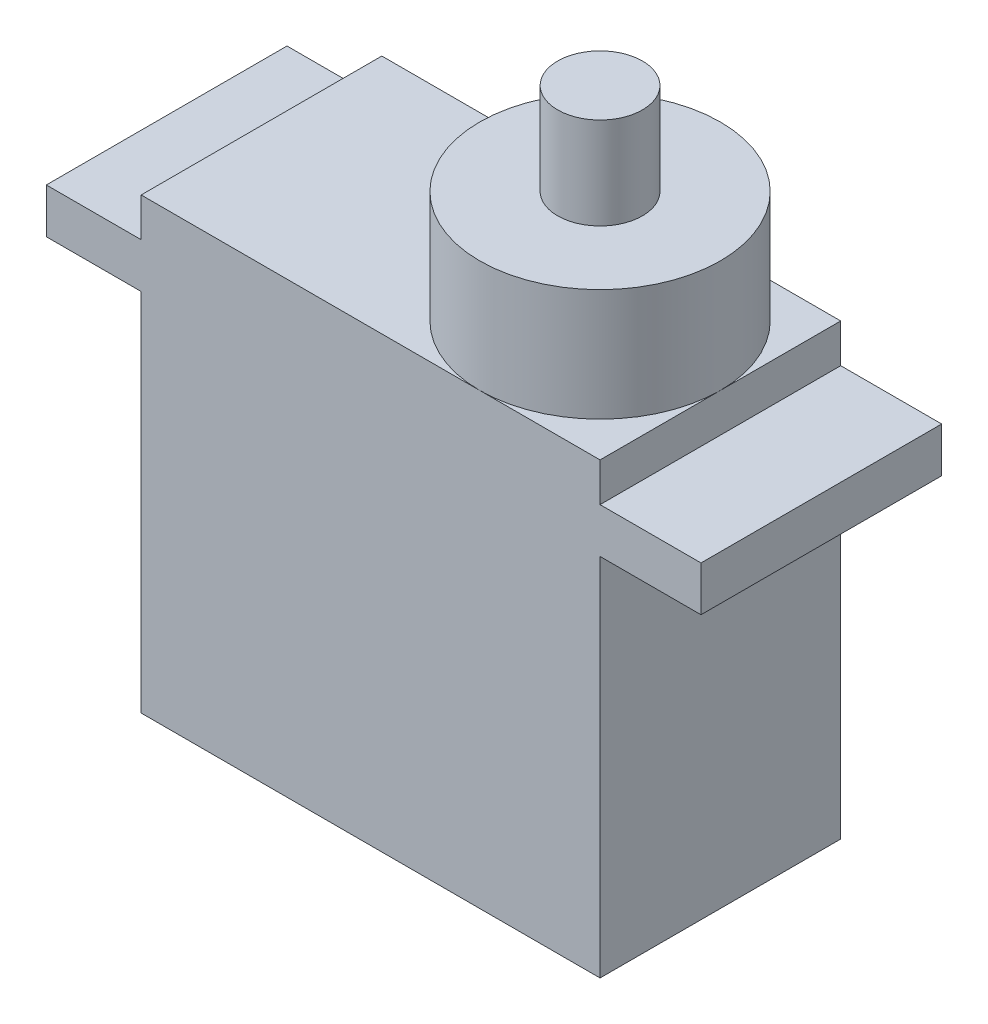
ISO-10303-21;
HEADER;
FILE_DESCRIPTION(('STEP AP214'),'2;1');
FILE_NAME('part.step','',(''),(''),'','','');
FILE_SCHEMA(('AUTOMOTIVE_DESIGN { 1 0 10303 214 1 1 1 1 }'));
ENDSEC;
DATA;
#1=APPLICATION_CONTEXT('core data for automotive mechanical design processes');
#2=APPLICATION_PROTOCOL_DEFINITION('international standard','automotive_design',2000,#1);
#3=PRODUCT_CONTEXT('',#1,'mechanical');
#4=PRODUCT('Part','Part','',(#3));
#5=PRODUCT_RELATED_PRODUCT_CATEGORY('part','',(#4));
#6=PRODUCT_DEFINITION_FORMATION('','',#4);
#7=PRODUCT_DEFINITION_CONTEXT('part definition',#1,'design');
#8=PRODUCT_DEFINITION('design','',#6,#7);
#9=PRODUCT_DEFINITION_SHAPE('','',#8);
#10=(LENGTH_UNIT() NAMED_UNIT(*) SI_UNIT(.MILLI.,.METRE.));
#11=(NAMED_UNIT(*) PLANE_ANGLE_UNIT() SI_UNIT($,.RADIAN.));
#12=(NAMED_UNIT(*) SI_UNIT($,.STERADIAN.) SOLID_ANGLE_UNIT());
#13=UNCERTAINTY_MEASURE_WITH_UNIT(LENGTH_MEASURE(1.E-05),#10,'distance_accuracy_value','');
#14=(GEOMETRIC_REPRESENTATION_CONTEXT(3) GLOBAL_UNCERTAINTY_ASSIGNED_CONTEXT((#13)) GLOBAL_UNIT_ASSIGNED_CONTEXT((#10,
#11,#12)) REPRESENTATION_CONTEXT('',''));
#15=CARTESIAN_POINT('',(0.,0.,0.));
#16=DIRECTION('',(0.,0.,1.));
#17=DIRECTION('',(1.,0.,0.));
#18=AXIS2_PLACEMENT_3D('',#15,#16,#17);
#19=CARTESIAN_POINT('',(22.5,17.9,-11.8));
#20=DIRECTION('',(-1.,0.,0.));
#21=DIRECTION('',(0.,0.,1.));
#22=AXIS2_PLACEMENT_3D('',#19,#20,#21);
#23=PLANE('',#22);
#24=DIRECTION('',(0.,0.,-1.));
#25=VECTOR('',#24,1.);
#26=CARTESIAN_POINT('',(22.5,17.9,-11.8));
#27=LINE('',#26,#25);
#28=CARTESIAN_POINT('',(22.5,17.9,0.));
#29=VERTEX_POINT('',#28);
#30=CARTESIAN_POINT('',(22.5,17.9,-11.8));
#31=VERTEX_POINT('',#30);
#32=EDGE_CURVE('E165',#29,#31,#27,.T.);
#33=ORIENTED_EDGE('',*,*,#32,.F.);
#34=DIRECTION('',(0.,-1.,0.));
#35=VECTOR('',#34,1.);
#36=CARTESIAN_POINT('',(22.5,17.9,0.));
#37=LINE('',#36,#35);
#38=CARTESIAN_POINT('',(22.5,0.,0.));
#39=VERTEX_POINT('',#38);
#40=EDGE_CURVE('E211',#29,#39,#37,.T.);
#41=ORIENTED_EDGE('',*,*,#40,.T.);
#42=DIRECTION('',(0.,0.,-1.));
#43=VECTOR('',#42,1.);
#44=CARTESIAN_POINT('',(22.5,0.,-11.8));
#45=LINE('',#44,#43);
#46=CARTESIAN_POINT('',(22.5,0.,-11.8));
#47=VERTEX_POINT('',#46);
#48=EDGE_CURVE('E199',#39,#47,#45,.T.);
#49=ORIENTED_EDGE('',*,*,#48,.T.);
#50=DIRECTION('',(0.,-1.,0.));
#51=VECTOR('',#50,1.);
#52=CARTESIAN_POINT('',(22.5,17.9,-11.8));
#53=LINE('',#52,#51);
#54=EDGE_CURVE('E219',#31,#47,#53,.T.);
#55=ORIENTED_EDGE('',*,*,#54,.F.);
#56=EDGE_LOOP('',(#33,#41,#49,#55));
#57=FACE_BOUND('',#56,.T.);
#58=ADVANCED_FACE('F37',(#57),#23,.F.);
#59=CARTESIAN_POINT('',(0.,17.9,-11.8));
#60=DIRECTION('',(1.,0.,0.));
#61=DIRECTION('',(0.,0.,-1.));
#62=AXIS2_PLACEMENT_3D('',#59,#60,#61);
#63=PLANE('',#62);
#64=DIRECTION('',(0.,0.,1.));
#65=VECTOR('',#64,1.);
#66=CARTESIAN_POINT('',(0.,17.9,-11.8));
#67=LINE('',#66,#65);
#68=CARTESIAN_POINT('',(0.,17.9,-11.8));
#69=VERTEX_POINT('',#68);
#70=CARTESIAN_POINT('',(0.,17.9,0.));
#71=VERTEX_POINT('',#70);
#72=EDGE_CURVE('E62',#69,#71,#67,.T.);
#73=ORIENTED_EDGE('',*,*,#72,.F.);
#74=DIRECTION('',(0.,-1.,0.));
#75=VECTOR('',#74,1.);
#76=CARTESIAN_POINT('',(0.,17.9,-11.8));
#77=LINE('',#76,#75);
#78=CARTESIAN_POINT('',(0.,0.,-11.8));
#79=VERTEX_POINT('',#78);
#80=EDGE_CURVE('E217',#69,#79,#77,.T.);
#81=ORIENTED_EDGE('',*,*,#80,.T.);
#82=DIRECTION('',(0.,0.,1.));
#83=VECTOR('',#82,1.);
#84=CARTESIAN_POINT('',(0.,0.,-11.8));
#85=LINE('',#84,#83);
#86=CARTESIAN_POINT('',(0.,0.,0.));
#87=VERTEX_POINT('',#86);
#88=EDGE_CURVE('E205',#79,#87,#85,.T.);
#89=ORIENTED_EDGE('',*,*,#88,.T.);
#90=DIRECTION('',(0.,-1.,0.));
#91=VECTOR('',#90,1.);
#92=CARTESIAN_POINT('',(0.,17.9,0.));
#93=LINE('',#92,#91);
#94=EDGE_CURVE('E214',#71,#87,#93,.T.);
#95=ORIENTED_EDGE('',*,*,#94,.F.);
#96=EDGE_LOOP('',(#73,#81,#89,#95));
#97=FACE_BOUND('',#96,.T.);
#98=ADVANCED_FACE('F222',(#97),#63,.F.);
#99=CARTESIAN_POINT('',(0.,22.,0.));
#100=DIRECTION('',(0.,1.,0.));
#101=DIRECTION('',(0.,0.,1.));
#102=AXIS2_PLACEMENT_3D('',#99,#100,#101);
#103=PLANE('',#102);
#104=CARTESIAN_POINT('',(16.6,22.,-5.9));
#105=DIRECTION('',(0.,1.,0.));
#106=DIRECTION('',(0.,0.,1.));
#107=AXIS2_PLACEMENT_3D('',#104,#105,#106);
#108=CIRCLE('',#107,5.9);
#109=CARTESIAN_POINT('',(16.6,22.,0.));
#110=VERTEX_POINT('',#109);
#111=CARTESIAN_POINT('',(22.5,22.,-5.9));
#112=VERTEX_POINT('',#111);
#113=EDGE_CURVE('E177',#110,#112,#108,.T.);
#114=ORIENTED_EDGE('',*,*,#113,.F.);
#115=DIRECTION('',(1.,0.,0.));
#116=VECTOR('',#115,1.);
#117=CARTESIAN_POINT('',(0.,22.,0.));
#118=LINE('',#117,#116);
#119=CARTESIAN_POINT('',(22.5,22.,0.));
#120=VERTEX_POINT('',#119);
#121=EDGE_CURVE('E182',#110,#120,#118,.T.);
#122=ORIENTED_EDGE('',*,*,#121,.T.);
#123=DIRECTION('',(0.,0.,-1.));
#124=VECTOR('',#123,1.);
#125=CARTESIAN_POINT('',(22.5,22.,0.));
#126=LINE('',#125,#124);
#127=EDGE_CURVE('E189',#120,#112,#126,.T.);
#128=ORIENTED_EDGE('',*,*,#127,.T.);
#129=EDGE_LOOP('',(#114,#122,#128));
#130=FACE_BOUND('',#129,.T.);
#131=ADVANCED_FACE('F276',(#130),#103,.T.);
#132=CARTESIAN_POINT('',(16.6,22.,-11.8));
#133=VERTEX_POINT('',#132);
#134=EDGE_CURVE('E46',#112,#133,#108,.T.);
#135=ORIENTED_EDGE('',*,*,#134,.F.);
#136=CARTESIAN_POINT('',(22.5,22.,-11.8));
#137=VERTEX_POINT('',#136);
#138=EDGE_CURVE('E188',#112,#137,#126,.T.);
#139=ORIENTED_EDGE('',*,*,#138,.T.);
#140=DIRECTION('',(-1.,0.,0.));
#141=VECTOR('',#140,1.);
#142=CARTESIAN_POINT('',(22.5,22.,-11.8));
#143=LINE('',#142,#141);
#144=EDGE_CURVE('E193',#137,#133,#143,.T.);
#145=ORIENTED_EDGE('',*,*,#144,.T.);
#146=EDGE_LOOP('',(#135,#139,#145));
#147=FACE_BOUND('',#146,.T.);
#148=ADVANCED_FACE('F285',(#147),#103,.T.);
#149=CARTESIAN_POINT('',(22.5,20.1,0.));
#150=VERTEX_POINT('',#149);
#151=EDGE_CURVE('E212',#120,#150,#37,.T.);
#152=ORIENTED_EDGE('',*,*,#151,.T.);
#153=DIRECTION('',(0.,0.,-1.));
#154=VECTOR('',#153,1.);
#155=CARTESIAN_POINT('',(22.5,20.1,-11.8));
#156=LINE('',#155,#154);
#157=CARTESIAN_POINT('',(22.5,20.1,-11.8));
#158=VERTEX_POINT('',#157);
#159=EDGE_CURVE('E54',#150,#158,#156,.T.);
#160=ORIENTED_EDGE('',*,*,#159,.T.);
#161=EDGE_CURVE('E41',#137,#158,#53,.T.);
#162=ORIENTED_EDGE('',*,*,#161,.F.);
#163=ORIENTED_EDGE('',*,*,#138,.F.);
#164=ORIENTED_EDGE('',*,*,#127,.F.);
#165=EDGE_LOOP('',(#152,#160,#162,#163,#164));
#166=FACE_BOUND('',#165,.T.);
#167=ADVANCED_FACE('F39',(#166),#23,.F.);
#168=CARTESIAN_POINT('',(22.5,17.9,-11.8));
#169=DIRECTION('',(0.,0.,1.));
#170=DIRECTION('',(1.,0.,0.));
#171=AXIS2_PLACEMENT_3D('',#168,#169,#170);
#172=PLANE('',#171);
#173=ORIENTED_EDGE('',*,*,#161,.T.);
#174=DIRECTION('',(-1.,0.,0.));
#175=VECTOR('',#174,1.);
#176=CARTESIAN_POINT('',(27.45,20.1,-11.8));
#177=LINE('',#176,#175);
#178=CARTESIAN_POINT('',(27.45,20.1,-11.8));
#179=VERTEX_POINT('',#178);
#180=EDGE_CURVE('E148',#179,#158,#177,.T.);
#181=ORIENTED_EDGE('',*,*,#180,.F.);
#182=DIRECTION('',(0.,-1.,0.));
#183=VECTOR('',#182,1.);
#184=CARTESIAN_POINT('',(27.45,20.1,-11.8));
#185=LINE('',#184,#183);
#186=CARTESIAN_POINT('',(27.45,17.9,-11.8));
#187=VERTEX_POINT('',#186);
#188=EDGE_CURVE('E250',#179,#187,#185,.T.);
#189=ORIENTED_EDGE('',*,*,#188,.T.);
#190=DIRECTION('',(-1.,0.,0.));
#191=VECTOR('',#190,1.);
#192=CARTESIAN_POINT('',(27.45,17.9,-11.8));
#193=LINE('',#192,#191);
#194=EDGE_CURVE('E240',#187,#31,#193,.T.);
#195=ORIENTED_EDGE('',*,*,#194,.T.);
#196=ORIENTED_EDGE('',*,*,#54,.T.);
#197=DIRECTION('',(-1.,0.,0.));
#198=VECTOR('',#197,1.);
#199=CARTESIAN_POINT('',(22.5,0.,-11.8));
#200=LINE('',#199,#198);
#201=EDGE_CURVE('E202',#47,#79,#200,.T.);
#202=ORIENTED_EDGE('',*,*,#201,.T.);
#203=ORIENTED_EDGE('',*,*,#80,.F.);
#204=CARTESIAN_POINT('',(-4.65,17.9,-11.8));
#205=VERTEX_POINT('',#204);
#206=EDGE_CURVE('E162',#69,#205,#193,.T.);
#207=ORIENTED_EDGE('',*,*,#206,.T.);
#208=DIRECTION('',(0.,-1.,0.));
#209=VECTOR('',#208,1.);
#210=CARTESIAN_POINT('',(-4.65,20.1,-11.8));
#211=LINE('',#210,#209);
#212=CARTESIAN_POINT('',(-4.65,20.1,-11.8));
#213=VERTEX_POINT('',#212);
#214=EDGE_CURVE('E154',#213,#205,#211,.T.);
#215=ORIENTED_EDGE('',*,*,#214,.F.);
#216=CARTESIAN_POINT('',(0.,20.1,-11.8));
#217=VERTEX_POINT('',#216);
#218=EDGE_CURVE('E138',#217,#213,#177,.T.);
#219=ORIENTED_EDGE('',*,*,#218,.F.);
#220=CARTESIAN_POINT('',(0.,22.,-11.8));
#221=VERTEX_POINT('',#220);
#222=EDGE_CURVE('E218',#221,#217,#77,.T.);
#223=ORIENTED_EDGE('',*,*,#222,.F.);
#224=EDGE_CURVE('E192',#133,#221,#143,.T.);
#225=ORIENTED_EDGE('',*,*,#224,.F.);
#226=ORIENTED_EDGE('',*,*,#144,.F.);
#227=EDGE_LOOP('',(#173,#181,#189,#195,#196,#202,#203,#207,#215,#219,#223,#225,#226));
#228=FACE_BOUND('',#227,.T.);
#229=ADVANCED_FACE('F160',(#228),#172,.F.);
#230=ORIENTED_EDGE('',*,*,#222,.T.);
#231=DIRECTION('',(0.,0.,1.));
#232=VECTOR('',#231,1.);
#233=CARTESIAN_POINT('',(0.,20.1,-11.8));
#234=LINE('',#233,#232);
#235=CARTESIAN_POINT('',(0.,20.1,0.));
#236=VERTEX_POINT('',#235);
#237=EDGE_CURVE('E144',#217,#236,#234,.T.);
#238=ORIENTED_EDGE('',*,*,#237,.T.);
#239=CARTESIAN_POINT('',(0.,22.,0.));
#240=VERTEX_POINT('',#239);
#241=EDGE_CURVE('E215',#240,#236,#93,.T.);
#242=ORIENTED_EDGE('',*,*,#241,.F.);
#243=DIRECTION('',(0.,0.,1.));
#244=VECTOR('',#243,1.);
#245=CARTESIAN_POINT('',(0.,22.,-11.8));
#246=LINE('',#245,#244);
#247=EDGE_CURVE('E196',#221,#240,#246,.T.);
#248=ORIENTED_EDGE('',*,*,#247,.F.);
#249=EDGE_LOOP('',(#230,#238,#242,#248));
#250=FACE_BOUND('',#249,.T.);
#251=ADVANCED_FACE('F301',(#250),#63,.F.);
#252=CARTESIAN_POINT('',(22.5,17.9,0.));
#253=DIRECTION('',(0.,0.,-1.));
#254=DIRECTION('',(-1.,0.,0.));
#255=AXIS2_PLACEMENT_3D('',#252,#253,#254);
#256=PLANE('',#255);
#257=ORIENTED_EDGE('',*,*,#241,.T.);
#258=DIRECTION('',(1.,0.,0.));
#259=VECTOR('',#258,1.);
#260=CARTESIAN_POINT('',(-4.65,20.1,0.));
#261=LINE('',#260,#259);
#262=CARTESIAN_POINT('',(-4.65,20.1,0.));
#263=VERTEX_POINT('',#262);
#264=EDGE_CURVE('E267',#263,#236,#261,.T.);
#265=ORIENTED_EDGE('',*,*,#264,.F.);
#266=DIRECTION('',(0.,-1.,0.));
#267=VECTOR('',#266,1.);
#268=CARTESIAN_POINT('',(-4.65,20.1,0.));
#269=LINE('',#268,#267);
#270=CARTESIAN_POINT('',(-4.65,17.9,0.));
#271=VERTEX_POINT('',#270);
#272=EDGE_CURVE('E156',#263,#271,#269,.T.);
#273=ORIENTED_EDGE('',*,*,#272,.T.);
#274=DIRECTION('',(1.,0.,0.));
#275=VECTOR('',#274,1.);
#276=CARTESIAN_POINT('',(-4.65,17.9,0.));
#277=LINE('',#276,#275);
#278=EDGE_CURVE('E236',#271,#71,#277,.T.);
#279=ORIENTED_EDGE('',*,*,#278,.T.);
#280=ORIENTED_EDGE('',*,*,#94,.T.);
#281=DIRECTION('',(1.,0.,0.));
#282=VECTOR('',#281,1.);
#283=CARTESIAN_POINT('',(22.5,0.,0.));
#284=LINE('',#283,#282);
#285=EDGE_CURVE('E208',#87,#39,#284,.T.);
#286=ORIENTED_EDGE('',*,*,#285,.T.);
#287=ORIENTED_EDGE('',*,*,#40,.F.);
#288=CARTESIAN_POINT('',(27.45,17.9,0.));
#289=VERTEX_POINT('',#288);
#290=EDGE_CURVE('E247',#29,#289,#277,.T.);
#291=ORIENTED_EDGE('',*,*,#290,.T.);
#292=DIRECTION('',(0.,-1.,0.));
#293=VECTOR('',#292,1.);
#294=CARTESIAN_POINT('',(27.45,20.1,0.));
#295=LINE('',#294,#293);
#296=CARTESIAN_POINT('',(27.45,20.1,0.));
#297=VERTEX_POINT('',#296);
#298=EDGE_CURVE('E167',#297,#289,#295,.T.);
#299=ORIENTED_EDGE('',*,*,#298,.F.);
#300=EDGE_CURVE('E158',#150,#297,#261,.T.);
#301=ORIENTED_EDGE('',*,*,#300,.F.);
#302=ORIENTED_EDGE('',*,*,#151,.F.);
#303=ORIENTED_EDGE('',*,*,#121,.F.);
#304=EDGE_CURVE('E186',#240,#110,#118,.T.);
#305=ORIENTED_EDGE('',*,*,#304,.F.);
#306=EDGE_LOOP('',(#257,#265,#273,#279,#280,#286,#287,#291,#299,#301,#302,#303,#305));
#307=FACE_BOUND('',#306,.T.);
#308=ADVANCED_FACE('F232',(#307),#256,.F.);
#309=CARTESIAN_POINT('',(0.,0.,0.));
#310=DIRECTION('',(0.,-1.,0.));
#311=DIRECTION('',(0.,0.,-1.));
#312=AXIS2_PLACEMENT_3D('',#309,#310,#311);
#313=PLANE('',#312);
#314=ORIENTED_EDGE('',*,*,#48,.F.);
#315=ORIENTED_EDGE('',*,*,#285,.F.);
#316=ORIENTED_EDGE('',*,*,#88,.F.);
#317=ORIENTED_EDGE('',*,*,#201,.F.);
#318=EDGE_LOOP('',(#314,#315,#316,#317));
#319=FACE_BOUND('',#318,.T.);
#320=ADVANCED_FACE('F229',(#319),#313,.T.);
#321=EDGE_CURVE('E185',#133,#110,#108,.T.);
#322=ORIENTED_EDGE('',*,*,#321,.F.);
#323=ORIENTED_EDGE('',*,*,#224,.T.);
#324=ORIENTED_EDGE('',*,*,#247,.T.);
#325=ORIENTED_EDGE('',*,*,#304,.T.);
#326=EDGE_LOOP('',(#322,#323,#324,#325));
#327=FACE_BOUND('',#326,.T.);
#328=ADVANCED_FACE('F283',(#327),#103,.T.);
#329=CARTESIAN_POINT('',(16.6,27.5,-5.9));
#330=DIRECTION('',(0.,-1.,0.));
#331=DIRECTION('',(0.,0.,-1.));
#332=AXIS2_PLACEMENT_3D('',#329,#330,#331);
#333=CYLINDRICAL_SURFACE('',#332,5.9);
#334=CARTESIAN_POINT('',(16.6,27.5,-5.9));
#335=DIRECTION('',(0.,1.,0.));
#336=DIRECTION('',(0.,0.,1.));
#337=AXIS2_PLACEMENT_3D('',#334,#335,#336);
#338=CIRCLE('',#337,5.9);
#339=CARTESIAN_POINT('',(16.6,27.5,0.));
#340=VERTEX_POINT('',#339);
#341=EDGE_CURVE('E179',#340,#340,#338,.T.);
#342=ORIENTED_EDGE('',*,*,#341,.F.);
#343=EDGE_LOOP('',(#342));
#344=FACE_BOUND('',#343,.T.);
#345=ORIENTED_EDGE('',*,*,#113,.T.);
#346=ORIENTED_EDGE('',*,*,#134,.T.);
#347=ORIENTED_EDGE('',*,*,#321,.T.);
#348=EDGE_LOOP('',(#345,#346,#347));
#349=FACE_BOUND('',#348,.T.);
#350=ADVANCED_FACE('F280',(#344,#349),#333,.T.);
#351=CARTESIAN_POINT('',(0.,27.5,0.));
#352=DIRECTION('',(0.,1.,0.));
#353=DIRECTION('',(0.,0.,1.));
#354=AXIS2_PLACEMENT_3D('',#351,#352,#353);
#355=PLANE('',#354);
#356=CARTESIAN_POINT('',(16.6,27.5,-5.9));
#357=DIRECTION('',(0.,1.,0.));
#358=DIRECTION('',(0.,0.,1.));
#359=AXIS2_PLACEMENT_3D('',#356,#357,#358);
#360=CIRCLE('',#359,2.07825760092678);
#361=CARTESIAN_POINT('',(16.6,27.5,-3.82174239907322));
#362=VERTEX_POINT('',#361);
#363=EDGE_CURVE('E11',#362,#362,#360,.T.);
#364=ORIENTED_EDGE('',*,*,#363,.F.);
#365=EDGE_LOOP('',(#364));
#366=FACE_BOUND('',#365,.T.);
#367=ORIENTED_EDGE('',*,*,#341,.T.);
#368=EDGE_LOOP('',(#367));
#369=FACE_BOUND('',#368,.T.);
#370=ADVANCED_FACE('F350',(#366,#369),#355,.T.);
#371=CARTESIAN_POINT('',(16.6,32.,-5.9));
#372=DIRECTION('',(0.,-1.,0.));
#373=DIRECTION('',(0.,0.,-1.));
#374=AXIS2_PLACEMENT_3D('',#371,#372,#373);
#375=CYLINDRICAL_SURFACE('',#374,2.07825760092678);
#376=CARTESIAN_POINT('',(16.6,32.,-5.9));
#377=DIRECTION('',(0.,1.,0.));
#378=DIRECTION('',(0.,0.,1.));
#379=AXIS2_PLACEMENT_3D('',#376,#377,#378);
#380=CIRCLE('',#379,2.07825760092678);
#381=CARTESIAN_POINT('',(16.6,32.,-3.82174239907322));
#382=VERTEX_POINT('',#381);
#383=EDGE_CURVE('E175',#382,#382,#380,.T.);
#384=ORIENTED_EDGE('',*,*,#383,.F.);
#385=EDGE_LOOP('',(#384));
#386=FACE_BOUND('',#385,.T.);
#387=ORIENTED_EDGE('',*,*,#363,.T.);
#388=EDGE_LOOP('',(#387));
#389=FACE_BOUND('',#388,.T.);
#390=ADVANCED_FACE('F339',(#386,#389),#375,.T.);
#391=CARTESIAN_POINT('',(0.,32.,0.));
#392=DIRECTION('',(0.,1.,0.));
#393=DIRECTION('',(0.,0.,1.));
#394=AXIS2_PLACEMENT_3D('',#391,#392,#393);
#395=PLANE('',#394);
#396=ORIENTED_EDGE('',*,*,#383,.T.);
#397=EDGE_LOOP('',(#396));
#398=FACE_BOUND('',#397,.T.);
#399=ADVANCED_FACE('F334',(#398),#395,.T.);
#400=CARTESIAN_POINT('',(-4.65,20.1,-11.8));
#401=DIRECTION('',(1.,0.,0.));
#402=DIRECTION('',(0.,0.,-1.));
#403=AXIS2_PLACEMENT_3D('',#400,#401,#402);
#404=PLANE('',#403);
#405=DIRECTION('',(0.,0.,1.));
#406=VECTOR('',#405,1.);
#407=CARTESIAN_POINT('',(-4.65,17.9,-11.8));
#408=LINE('',#407,#406);
#409=EDGE_CURVE('E239',#205,#271,#408,.T.);
#410=ORIENTED_EDGE('',*,*,#409,.T.);
#411=ORIENTED_EDGE('',*,*,#272,.F.);
#412=DIRECTION('',(0.,0.,1.));
#413=VECTOR('',#412,1.);
#414=CARTESIAN_POINT('',(-4.65,20.1,-11.8));
#415=LINE('',#414,#413);
#416=EDGE_CURVE('E142',#213,#263,#415,.T.);
#417=ORIENTED_EDGE('',*,*,#416,.F.);
#418=ORIENTED_EDGE('',*,*,#214,.T.);
#419=EDGE_LOOP('',(#410,#411,#417,#418));
#420=FACE_BOUND('',#419,.T.);
#421=ADVANCED_FACE('F153',(#420),#404,.F.);
#422=CARTESIAN_POINT('',(0.,20.1,0.));
#423=DIRECTION('',(0.,1.,0.));
#424=DIRECTION('',(0.,0.,1.));
#425=AXIS2_PLACEMENT_3D('',#422,#423,#424);
#426=PLANE('',#425);
#427=ORIENTED_EDGE('',*,*,#237,.F.);
#428=ORIENTED_EDGE('',*,*,#218,.T.);
#429=ORIENTED_EDGE('',*,*,#416,.T.);
#430=ORIENTED_EDGE('',*,*,#264,.T.);
#431=EDGE_LOOP('',(#427,#428,#429,#430));
#432=FACE_BOUND('',#431,.T.);
#433=ADVANCED_FACE('F140',(#432),#426,.T.);
#434=CARTESIAN_POINT('',(0.,17.9,0.));
#435=DIRECTION('',(0.,1.,0.));
#436=DIRECTION('',(0.,0.,1.));
#437=AXIS2_PLACEMENT_3D('',#434,#435,#436);
#438=PLANE('',#437);
#439=ORIENTED_EDGE('',*,*,#206,.F.);
#440=ORIENTED_EDGE('',*,*,#72,.T.);
#441=ORIENTED_EDGE('',*,*,#278,.F.);
#442=ORIENTED_EDGE('',*,*,#409,.F.);
#443=EDGE_LOOP('',(#439,#440,#441,#442));
#444=FACE_BOUND('',#443,.T.);
#445=ADVANCED_FACE('F238',(#444),#438,.F.);
#446=ORIENTED_EDGE('',*,*,#159,.F.);
#447=ORIENTED_EDGE('',*,*,#300,.T.);
#448=DIRECTION('',(0.,0.,-1.));
#449=VECTOR('',#448,1.);
#450=CARTESIAN_POINT('',(27.45,20.1,-11.8));
#451=LINE('',#450,#449);
#452=EDGE_CURVE('E244',#297,#179,#451,.T.);
#453=ORIENTED_EDGE('',*,*,#452,.T.);
#454=ORIENTED_EDGE('',*,*,#180,.T.);
#455=EDGE_LOOP('',(#446,#447,#453,#454));
#456=FACE_BOUND('',#455,.T.);
#457=ADVANCED_FACE('F268',(#456),#426,.T.);
#458=ORIENTED_EDGE('',*,*,#290,.F.);
#459=ORIENTED_EDGE('',*,*,#32,.T.);
#460=ORIENTED_EDGE('',*,*,#194,.F.);
#461=DIRECTION('',(0.,0.,-1.));
#462=VECTOR('',#461,1.);
#463=CARTESIAN_POINT('',(27.45,17.9,-11.8));
#464=LINE('',#463,#462);
#465=EDGE_CURVE('E149',#289,#187,#464,.T.);
#466=ORIENTED_EDGE('',*,*,#465,.F.);
#467=EDGE_LOOP('',(#458,#459,#460,#466));
#468=FACE_BOUND('',#467,.T.);
#469=ADVANCED_FACE('F262',(#468),#438,.F.);
#470=CARTESIAN_POINT('',(27.45,20.1,-11.8));
#471=DIRECTION('',(-1.,0.,0.));
#472=DIRECTION('',(0.,0.,1.));
#473=AXIS2_PLACEMENT_3D('',#470,#471,#472);
#474=PLANE('',#473);
#475=ORIENTED_EDGE('',*,*,#465,.T.);
#476=ORIENTED_EDGE('',*,*,#188,.F.);
#477=ORIENTED_EDGE('',*,*,#452,.F.);
#478=ORIENTED_EDGE('',*,*,#298,.T.);
#479=EDGE_LOOP('',(#475,#476,#477,#478));
#480=FACE_BOUND('',#479,.T.);
#481=ADVANCED_FACE('F257',(#480),#474,.F.);
#482=CLOSED_SHELL('',(#58,#98,#131,#148,#167,#229,#251,#308,#320,#328,#350,#370,#390,#399,#421,
#433,#445,#457,#469,#481));
#483=MANIFOLD_SOLID_BREP('B2',#482);
#484=ADVANCED_BREP_SHAPE_REPRESENTATION('',(#18,#483),#14);
#485=SHAPE_DEFINITION_REPRESENTATION(#9,#484);
ENDSEC;
END-ISO-10303-21;
